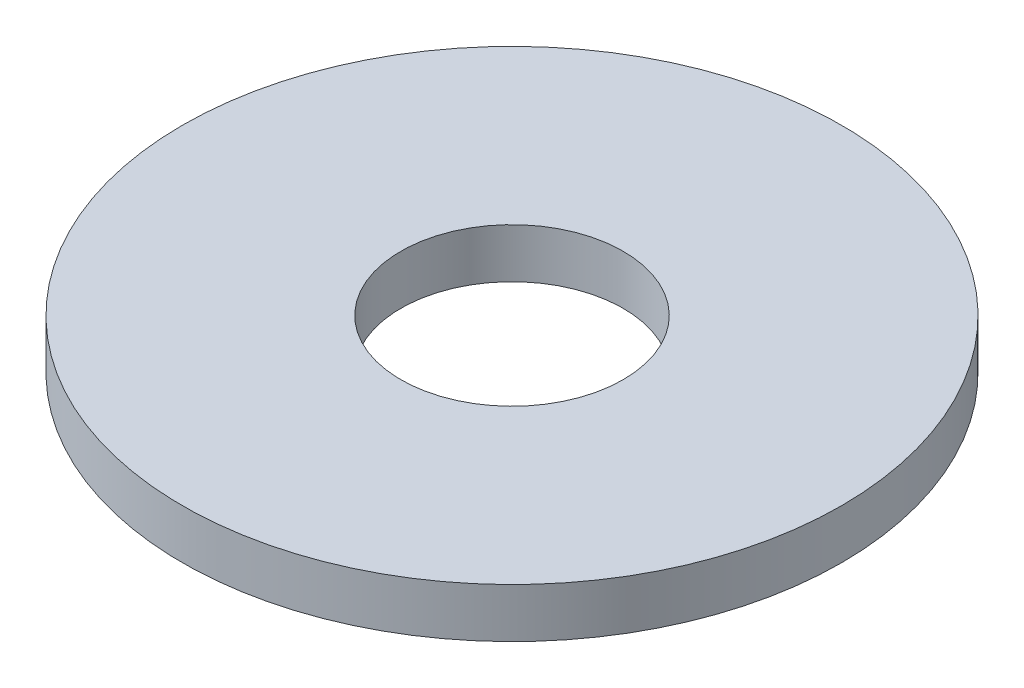
ISO-10303-21;
HEADER;
FILE_DESCRIPTION(('STEP AP214'),'2;1');
FILE_NAME('part.step','',(''),(''),'','','');
FILE_SCHEMA(('AUTOMOTIVE_DESIGN { 1 0 10303 214 1 1 1 1 }'));
ENDSEC;
DATA;
#1=APPLICATION_CONTEXT('core data for automotive mechanical design processes');
#2=APPLICATION_PROTOCOL_DEFINITION('international standard','automotive_design',2000,#1);
#3=PRODUCT_CONTEXT('',#1,'mechanical');
#4=PRODUCT('Part','Part','',(#3));
#5=PRODUCT_RELATED_PRODUCT_CATEGORY('part','',(#4));
#6=PRODUCT_DEFINITION_FORMATION('','',#4);
#7=PRODUCT_DEFINITION_CONTEXT('part definition',#1,'design');
#8=PRODUCT_DEFINITION('design','',#6,#7);
#9=PRODUCT_DEFINITION_SHAPE('','',#8);
#10=(LENGTH_UNIT() NAMED_UNIT(*) SI_UNIT(.MILLI.,.METRE.));
#11=(NAMED_UNIT(*) PLANE_ANGLE_UNIT() SI_UNIT($,.RADIAN.));
#12=(NAMED_UNIT(*) SI_UNIT($,.STERADIAN.) SOLID_ANGLE_UNIT());
#13=UNCERTAINTY_MEASURE_WITH_UNIT(LENGTH_MEASURE(1.E-05),#10,'distance_accuracy_value','');
#14=(GEOMETRIC_REPRESENTATION_CONTEXT(3) GLOBAL_UNCERTAINTY_ASSIGNED_CONTEXT((#13)) GLOBAL_UNIT_ASSIGNED_CONTEXT((#10,
#11,#12)) REPRESENTATION_CONTEXT('',''));
#15=CARTESIAN_POINT('',(0.,0.,0.));
#16=DIRECTION('',(0.,0.,1.));
#17=DIRECTION('',(1.,0.,0.));
#18=AXIS2_PLACEMENT_3D('',#15,#16,#17);
#19=CARTESIAN_POINT('',(0.,0.,0.));
#20=DIRECTION('',(0.,1.,0.));
#21=DIRECTION('',(-1.,0.,0.));
#22=AXIS2_PLACEMENT_3D('',#19,#20,#21);
#23=PLANE('',#22);
#24=CARTESIAN_POINT('',(0.,0.,0.));
#25=DIRECTION('',(0.,-1.,0.));
#26=DIRECTION('',(1.,0.,0.));
#27=AXIS2_PLACEMENT_3D('',#24,#25,#26);
#28=CIRCLE('',#27,13.5000000000001);
#29=CARTESIAN_POINT('',(13.5000000000001,0.,0.));
#30=VERTEX_POINT('',#29);
#31=EDGE_CURVE('E26',#30,#30,#28,.F.);
#32=ORIENTED_EDGE('',*,*,#31,.T.);
#33=EDGE_LOOP('',(#32));
#34=FACE_BOUND('',#33,.T.);
#35=CARTESIAN_POINT('',(0.,0.,0.));
#36=DIRECTION('',(0.,-1.,0.));
#37=DIRECTION('',(1.,0.,0.));
#38=AXIS2_PLACEMENT_3D('',#35,#36,#37);
#39=CIRCLE('',#38,40.0000000000003);
#40=CARTESIAN_POINT('',(40.0000000000003,0.,0.));
#41=VERTEX_POINT('',#40);
#42=EDGE_CURVE('E17',#41,#41,#39,.F.);
#43=ORIENTED_EDGE('',*,*,#42,.F.);
#44=EDGE_LOOP('',(#43));
#45=FACE_BOUND('',#44,.T.);
#46=ADVANCED_FACE('F14',(#34,#45),#23,.F.);
#47=CARTESIAN_POINT('',(0.,6.00000000000001,0.));
#48=DIRECTION('',(0.,-1.,0.));
#49=DIRECTION('',(1.,0.,0.));
#50=AXIS2_PLACEMENT_3D('',#47,#48,#49);
#51=CYLINDRICAL_SURFACE('',#50,40.0000000000003);
#52=ORIENTED_EDGE('',*,*,#42,.T.);
#53=EDGE_LOOP('',(#52));
#54=FACE_BOUND('',#53,.T.);
#55=CARTESIAN_POINT('',(0.,6.00000000000001,0.));
#56=DIRECTION('',(0.,-1.,0.));
#57=DIRECTION('',(1.,0.,0.));
#58=AXIS2_PLACEMENT_3D('',#55,#56,#57);
#59=CIRCLE('',#58,40.0000000000003);
#60=CARTESIAN_POINT('',(40.0000000000003,6.00000000000001,0.));
#61=VERTEX_POINT('',#60);
#62=EDGE_CURVE('E21',#61,#61,#59,.F.);
#63=ORIENTED_EDGE('',*,*,#62,.F.);
#64=EDGE_LOOP('',(#63));
#65=FACE_BOUND('',#64,.T.);
#66=ADVANCED_FACE('F34',(#54,#65),#51,.T.);
#67=CARTESIAN_POINT('',(0.,6.00000000000001,0.));
#68=DIRECTION('',(0.,-1.,0.));
#69=DIRECTION('',(1.,0.,0.));
#70=AXIS2_PLACEMENT_3D('',#67,#68,#69);
#71=CYLINDRICAL_SURFACE('',#70,13.5000000000001);
#72=CARTESIAN_POINT('',(0.,6.00000000000001,0.));
#73=DIRECTION('',(0.,-1.,0.));
#74=DIRECTION('',(1.,0.,0.));
#75=AXIS2_PLACEMENT_3D('',#72,#73,#74);
#76=CIRCLE('',#75,13.5000000000001);
#77=CARTESIAN_POINT('',(13.5000000000001,6.00000000000001,0.));
#78=VERTEX_POINT('',#77);
#79=EDGE_CURVE('E10',#78,#78,#76,.T.);
#80=ORIENTED_EDGE('',*,*,#79,.F.);
#81=EDGE_LOOP('',(#80));
#82=FACE_BOUND('',#81,.T.);
#83=ORIENTED_EDGE('',*,*,#31,.F.);
#84=EDGE_LOOP('',(#83));
#85=FACE_BOUND('',#84,.T.);
#86=ADVANCED_FACE('F42',(#82,#85),#71,.F.);
#87=CARTESIAN_POINT('',(0.,6.00000000000001,0.));
#88=DIRECTION('',(0.,1.,0.));
#89=DIRECTION('',(-1.,0.,0.));
#90=AXIS2_PLACEMENT_3D('',#87,#88,#89);
#91=PLANE('',#90);
#92=ORIENTED_EDGE('',*,*,#79,.T.);
#93=EDGE_LOOP('',(#92));
#94=FACE_BOUND('',#93,.T.);
#95=ORIENTED_EDGE('',*,*,#62,.T.);
#96=EDGE_LOOP('',(#95));
#97=FACE_BOUND('',#96,.T.);
#98=ADVANCED_FACE('F43',(#94,#97),#91,.T.);
#99=CLOSED_SHELL('',(#46,#66,#86,#98));
#100=MANIFOLD_SOLID_BREP('B1',#99);
#101=ADVANCED_BREP_SHAPE_REPRESENTATION('',(#18,#100),#14);
#102=SHAPE_DEFINITION_REPRESENTATION(#9,#101);
ENDSEC;
END-ISO-10303-21;
